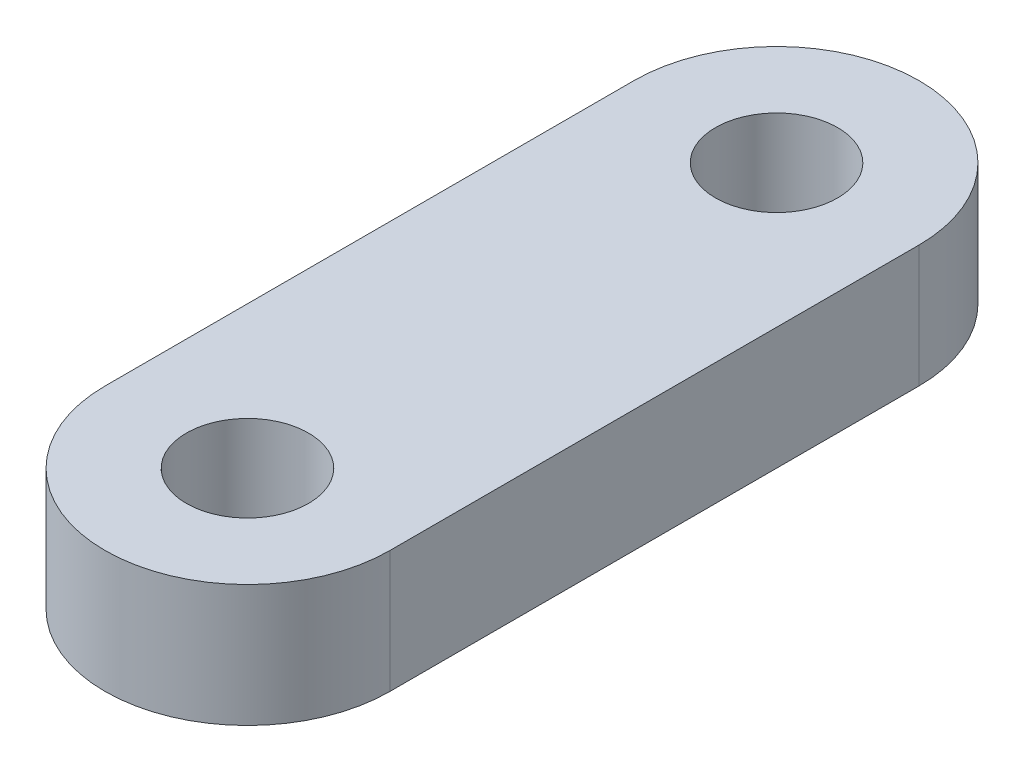
ISO-10303-21;
HEADER;
FILE_DESCRIPTION(('STEP AP214'),'2;1');
FILE_NAME('part.step','',(''),(''),'','','');
FILE_SCHEMA(('AUTOMOTIVE_DESIGN { 1 0 10303 214 1 1 1 1 }'));
ENDSEC;
DATA;
#1=APPLICATION_CONTEXT('core data for automotive mechanical design processes');
#2=APPLICATION_PROTOCOL_DEFINITION('international standard','automotive_design',2000,#1);
#3=PRODUCT_CONTEXT('',#1,'mechanical');
#4=PRODUCT('Part','Part','',(#3));
#5=PRODUCT_RELATED_PRODUCT_CATEGORY('part','',(#4));
#6=PRODUCT_DEFINITION_FORMATION('','',#4);
#7=PRODUCT_DEFINITION_CONTEXT('part definition',#1,'design');
#8=PRODUCT_DEFINITION('design','',#6,#7);
#9=PRODUCT_DEFINITION_SHAPE('','',#8);
#10=(LENGTH_UNIT() NAMED_UNIT(*) SI_UNIT(.MILLI.,.METRE.));
#11=(NAMED_UNIT(*) PLANE_ANGLE_UNIT() SI_UNIT($,.RADIAN.));
#12=(NAMED_UNIT(*) SI_UNIT($,.STERADIAN.) SOLID_ANGLE_UNIT());
#13=UNCERTAINTY_MEASURE_WITH_UNIT(LENGTH_MEASURE(1.E-05),#10,'distance_accuracy_value','');
#14=(GEOMETRIC_REPRESENTATION_CONTEXT(3) GLOBAL_UNCERTAINTY_ASSIGNED_CONTEXT((#13)) GLOBAL_UNIT_ASSIGNED_CONTEXT((#10,
#11,#12)) REPRESENTATION_CONTEXT('',''));
#15=CARTESIAN_POINT('',(0.,0.,0.));
#16=DIRECTION('',(0.,0.,1.));
#17=DIRECTION('',(1.,0.,0.));
#18=AXIS2_PLACEMENT_3D('',#15,#16,#17);
#19=CARTESIAN_POINT('',(0.,1.5,6.5));
#20=DIRECTION('',(0.,1.,0.));
#21=DIRECTION('',(0.,0.,1.));
#22=AXIS2_PLACEMENT_3D('',#19,#20,#21);
#23=PLANE('',#22);
#24=CARTESIAN_POINT('',(0.,1.5,-6.5));
#25=DIRECTION('',(0.,1.,0.));
#26=DIRECTION('',(0.,0.,1.));
#27=AXIS2_PLACEMENT_3D('',#24,#25,#26);
#28=CIRCLE('',#27,1.5);
#29=CARTESIAN_POINT('',(0.,1.5,-5.));
#30=VERTEX_POINT('',#29);
#31=EDGE_CURVE('E102',#30,#30,#28,.T.);
#32=ORIENTED_EDGE('',*,*,#31,.F.);
#33=EDGE_LOOP('',(#32));
#34=FACE_BOUND('',#33,.T.);
#35=CARTESIAN_POINT('',(0.,1.5,6.5));
#36=DIRECTION('',(0.,1.,0.));
#37=DIRECTION('',(0.,0.,1.));
#38=AXIS2_PLACEMENT_3D('',#35,#36,#37);
#39=CIRCLE('',#38,3.5);
#40=CARTESIAN_POINT('',(-3.5,1.5,6.5));
#41=VERTEX_POINT('',#40);
#42=CARTESIAN_POINT('',(3.5,1.5,6.5));
#43=VERTEX_POINT('',#42);
#44=EDGE_CURVE('E87',#41,#43,#39,.T.);
#45=ORIENTED_EDGE('',*,*,#44,.T.);
#46=DIRECTION('',(0.,0.,-1.));
#47=VECTOR('',#46,1.);
#48=CARTESIAN_POINT('',(3.5,1.5,6.5));
#49=LINE('',#48,#47);
#50=CARTESIAN_POINT('',(3.5,1.5,-6.5));
#51=VERTEX_POINT('',#50);
#52=EDGE_CURVE('E82',#43,#51,#49,.T.);
#53=ORIENTED_EDGE('',*,*,#52,.T.);
#54=CARTESIAN_POINT('',(0.,1.5,-6.5));
#55=DIRECTION('',(0.,1.,0.));
#56=DIRECTION('',(0.,0.,1.));
#57=AXIS2_PLACEMENT_3D('',#54,#55,#56);
#58=CIRCLE('',#57,3.5);
#59=CARTESIAN_POINT('',(-3.5,1.5,-6.5));
#60=VERTEX_POINT('',#59);
#61=EDGE_CURVE('E85',#51,#60,#58,.T.);
#62=ORIENTED_EDGE('',*,*,#61,.T.);
#63=DIRECTION('',(0.,0.,1.));
#64=VECTOR('',#63,1.);
#65=CARTESIAN_POINT('',(-3.5,1.5,6.5));
#66=LINE('',#65,#64);
#67=EDGE_CURVE('E52',#60,#41,#66,.T.);
#68=ORIENTED_EDGE('',*,*,#67,.T.);
#69=EDGE_LOOP('',(#45,#53,#62,#68));
#70=FACE_BOUND('',#69,.T.);
#71=CARTESIAN_POINT('',(0.,1.5,6.5));
#72=DIRECTION('',(0.,1.,0.));
#73=DIRECTION('',(0.,0.,1.));
#74=AXIS2_PLACEMENT_3D('',#71,#72,#73);
#75=CIRCLE('',#74,1.5);
#76=CARTESIAN_POINT('',(0.,1.5,8.));
#77=VERTEX_POINT('',#76);
#78=EDGE_CURVE('E117',#77,#77,#75,.T.);
#79=ORIENTED_EDGE('',*,*,#78,.F.);
#80=EDGE_LOOP('',(#79));
#81=FACE_BOUND('',#80,.T.);
#82=ADVANCED_FACE('F35',(#34,#70,#81),#23,.T.);
#83=CARTESIAN_POINT('',(0.,-1.5,6.5));
#84=DIRECTION('',(0.,1.,0.));
#85=DIRECTION('',(0.,0.,1.));
#86=AXIS2_PLACEMENT_3D('',#83,#84,#85);
#87=PLANE('',#86);
#88=CARTESIAN_POINT('',(0.,-1.5,6.5));
#89=DIRECTION('',(0.,1.,0.));
#90=DIRECTION('',(0.,0.,1.));
#91=AXIS2_PLACEMENT_3D('',#88,#89,#90);
#92=CIRCLE('',#91,3.5);
#93=CARTESIAN_POINT('',(-3.5,-1.5,6.5));
#94=VERTEX_POINT('',#93);
#95=CARTESIAN_POINT('',(3.5,-1.5,6.5));
#96=VERTEX_POINT('',#95);
#97=EDGE_CURVE('E99',#94,#96,#92,.T.);
#98=ORIENTED_EDGE('',*,*,#97,.F.);
#99=DIRECTION('',(0.,0.,1.));
#100=VECTOR('',#99,1.);
#101=CARTESIAN_POINT('',(-3.5,-1.5,6.5));
#102=LINE('',#101,#100);
#103=CARTESIAN_POINT('',(-3.5,-1.5,-6.5));
#104=VERTEX_POINT('',#103);
#105=EDGE_CURVE('E75',#104,#94,#102,.T.);
#106=ORIENTED_EDGE('',*,*,#105,.F.);
#107=CARTESIAN_POINT('',(0.,-1.5,-6.5));
#108=DIRECTION('',(0.,1.,0.));
#109=DIRECTION('',(0.,0.,1.));
#110=AXIS2_PLACEMENT_3D('',#107,#108,#109);
#111=CIRCLE('',#110,3.5);
#112=CARTESIAN_POINT('',(3.5,-1.5,-6.5));
#113=VERTEX_POINT('',#112);
#114=EDGE_CURVE('E69',#113,#104,#111,.T.);
#115=ORIENTED_EDGE('',*,*,#114,.F.);
#116=DIRECTION('',(0.,0.,-1.));
#117=VECTOR('',#116,1.);
#118=CARTESIAN_POINT('',(3.5,-1.5,6.5));
#119=LINE('',#118,#117);
#120=EDGE_CURVE('E91',#96,#113,#119,.T.);
#121=ORIENTED_EDGE('',*,*,#120,.F.);
#122=EDGE_LOOP('',(#98,#106,#115,#121));
#123=FACE_BOUND('',#122,.T.);
#124=CARTESIAN_POINT('',(0.,-1.5,-6.5));
#125=DIRECTION('',(0.,1.,0.));
#126=DIRECTION('',(0.,0.,1.));
#127=AXIS2_PLACEMENT_3D('',#124,#125,#126);
#128=CIRCLE('',#127,1.5);
#129=CARTESIAN_POINT('',(0.,-1.5,-5.));
#130=VERTEX_POINT('',#129);
#131=EDGE_CURVE('E114',#130,#130,#128,.T.);
#132=ORIENTED_EDGE('',*,*,#131,.T.);
#133=EDGE_LOOP('',(#132));
#134=FACE_BOUND('',#133,.T.);
#135=CARTESIAN_POINT('',(0.,-1.5,6.5));
#136=DIRECTION('',(0.,1.,0.));
#137=DIRECTION('',(0.,0.,1.));
#138=AXIS2_PLACEMENT_3D('',#135,#136,#137);
#139=CIRCLE('',#138,1.5);
#140=CARTESIAN_POINT('',(0.,-1.5,8.));
#141=VERTEX_POINT('',#140);
#142=EDGE_CURVE('E120',#141,#141,#139,.T.);
#143=ORIENTED_EDGE('',*,*,#142,.T.);
#144=EDGE_LOOP('',(#143));
#145=FACE_BOUND('',#144,.T.);
#146=ADVANCED_FACE('F110',(#123,#134,#145),#87,.F.);
#147=CARTESIAN_POINT('',(0.,1.5,6.5));
#148=DIRECTION('',(0.,-1.,0.));
#149=DIRECTION('',(0.,0.,-1.));
#150=AXIS2_PLACEMENT_3D('',#147,#148,#149);
#151=CYLINDRICAL_SURFACE('',#150,3.5);
#152=ORIENTED_EDGE('',*,*,#97,.T.);
#153=DIRECTION('',(0.,-1.,0.));
#154=VECTOR('',#153,1.);
#155=CARTESIAN_POINT('',(3.5,1.5,6.5));
#156=LINE('',#155,#154);
#157=EDGE_CURVE('E11',#43,#96,#156,.T.);
#158=ORIENTED_EDGE('',*,*,#157,.F.);
#159=ORIENTED_EDGE('',*,*,#44,.F.);
#160=DIRECTION('',(0.,-1.,0.));
#161=VECTOR('',#160,1.);
#162=CARTESIAN_POINT('',(-3.5,1.5,6.5));
#163=LINE('',#162,#161);
#164=EDGE_CURVE('E95',#41,#94,#163,.T.);
#165=ORIENTED_EDGE('',*,*,#164,.T.);
#166=EDGE_LOOP('',(#152,#158,#159,#165));
#167=FACE_BOUND('',#166,.T.);
#168=ADVANCED_FACE('F37',(#167),#151,.T.);
#169=CARTESIAN_POINT('',(3.5,1.5,6.5));
#170=DIRECTION('',(-1.,0.,0.));
#171=DIRECTION('',(0.,0.,1.));
#172=AXIS2_PLACEMENT_3D('',#169,#170,#171);
#173=PLANE('',#172);
#174=ORIENTED_EDGE('',*,*,#120,.T.);
#175=DIRECTION('',(0.,-1.,0.));
#176=VECTOR('',#175,1.);
#177=CARTESIAN_POINT('',(3.5,1.5,-6.5));
#178=LINE('',#177,#176);
#179=EDGE_CURVE('E44',#51,#113,#178,.T.);
#180=ORIENTED_EDGE('',*,*,#179,.F.);
#181=ORIENTED_EDGE('',*,*,#52,.F.);
#182=ORIENTED_EDGE('',*,*,#157,.T.);
#183=EDGE_LOOP('',(#174,#180,#181,#182));
#184=FACE_BOUND('',#183,.T.);
#185=ADVANCED_FACE('F90',(#184),#173,.F.);
#186=CARTESIAN_POINT('',(0.,1.5,-6.5));
#187=DIRECTION('',(0.,-1.,0.));
#188=DIRECTION('',(0.,0.,-1.));
#189=AXIS2_PLACEMENT_3D('',#186,#187,#188);
#190=CYLINDRICAL_SURFACE('',#189,3.5);
#191=ORIENTED_EDGE('',*,*,#114,.T.);
#192=DIRECTION('',(0.,-1.,0.));
#193=VECTOR('',#192,1.);
#194=CARTESIAN_POINT('',(-3.5,1.5,-6.5));
#195=LINE('',#194,#193);
#196=EDGE_CURVE('E92',#60,#104,#195,.T.);
#197=ORIENTED_EDGE('',*,*,#196,.F.);
#198=ORIENTED_EDGE('',*,*,#61,.F.);
#199=ORIENTED_EDGE('',*,*,#179,.T.);
#200=EDGE_LOOP('',(#191,#197,#198,#199));
#201=FACE_BOUND('',#200,.T.);
#202=ADVANCED_FACE('F93',(#201),#190,.T.);
#203=CARTESIAN_POINT('',(-3.5,1.5,6.5));
#204=DIRECTION('',(1.,0.,0.));
#205=DIRECTION('',(0.,0.,-1.));
#206=AXIS2_PLACEMENT_3D('',#203,#204,#205);
#207=PLANE('',#206);
#208=ORIENTED_EDGE('',*,*,#105,.T.);
#209=ORIENTED_EDGE('',*,*,#164,.F.);
#210=ORIENTED_EDGE('',*,*,#67,.F.);
#211=ORIENTED_EDGE('',*,*,#196,.T.);
#212=EDGE_LOOP('',(#208,#209,#210,#211));
#213=FACE_BOUND('',#212,.T.);
#214=ADVANCED_FACE('F107',(#213),#207,.F.);
#215=CARTESIAN_POINT('',(0.,1.5,-6.5));
#216=DIRECTION('',(0.,-1.,0.));
#217=DIRECTION('',(0.,0.,-1.));
#218=AXIS2_PLACEMENT_3D('',#215,#216,#217);
#219=CYLINDRICAL_SURFACE('',#218,1.5);
#220=ORIENTED_EDGE('',*,*,#31,.T.);
#221=EDGE_LOOP('',(#220));
#222=FACE_BOUND('',#221,.T.);
#223=ORIENTED_EDGE('',*,*,#131,.F.);
#224=EDGE_LOOP('',(#223));
#225=FACE_BOUND('',#224,.T.);
#226=ADVANCED_FACE('F137',(#222,#225),#219,.F.);
#227=CARTESIAN_POINT('',(0.,1.5,6.5));
#228=DIRECTION('',(0.,-1.,0.));
#229=DIRECTION('',(0.,0.,-1.));
#230=AXIS2_PLACEMENT_3D('',#227,#228,#229);
#231=CYLINDRICAL_SURFACE('',#230,1.5);
#232=ORIENTED_EDGE('',*,*,#78,.T.);
#233=EDGE_LOOP('',(#232));
#234=FACE_BOUND('',#233,.T.);
#235=ORIENTED_EDGE('',*,*,#142,.F.);
#236=EDGE_LOOP('',(#235));
#237=FACE_BOUND('',#236,.T.);
#238=ADVANCED_FACE('F126',(#234,#237),#231,.F.);
#239=CLOSED_SHELL('',(#82,#146,#168,#185,#202,#214,#226,#238));
#240=MANIFOLD_SOLID_BREP('B2',#239);
#241=ADVANCED_BREP_SHAPE_REPRESENTATION('',(#18,#240),#14);
#242=SHAPE_DEFINITION_REPRESENTATION(#9,#241);
ENDSEC;
END-ISO-10303-21;
